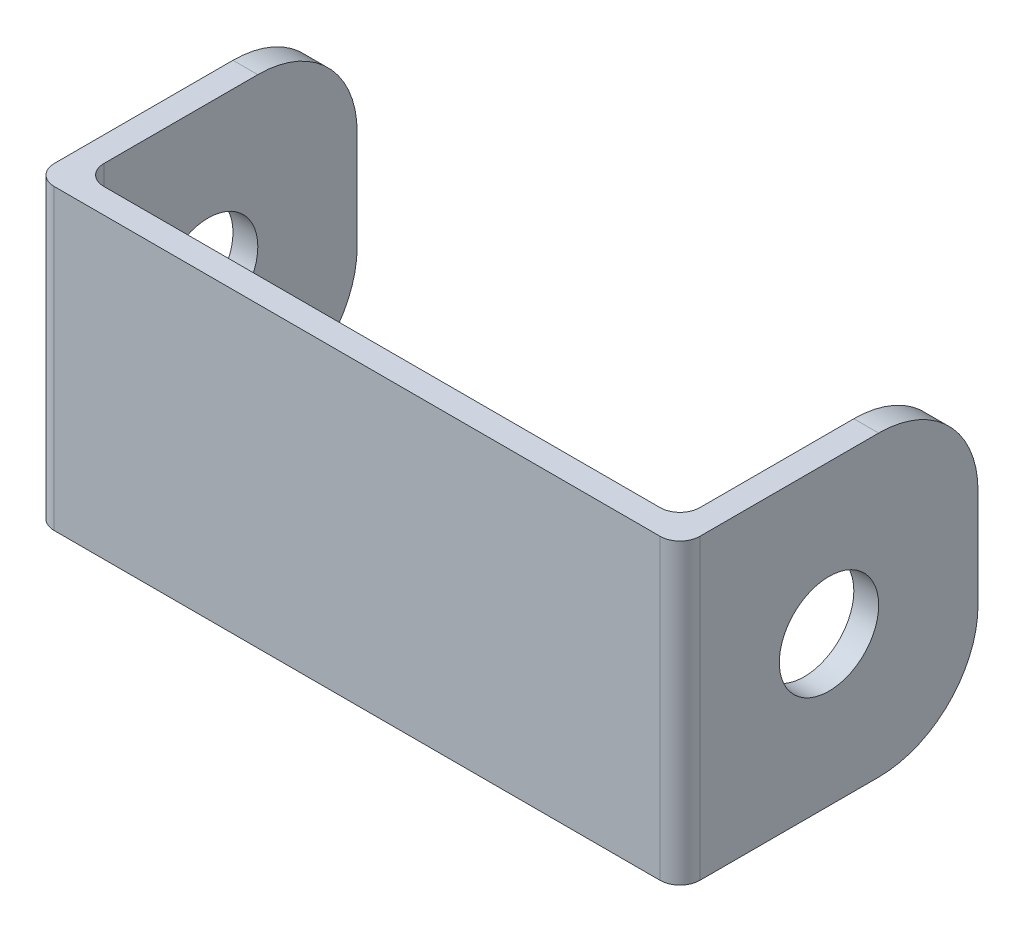
ISO-10303-21;
HEADER;
FILE_DESCRIPTION(('STEP AP214'),'2;1');
FILE_NAME('part.step','',(''),(''),'','','');
FILE_SCHEMA(('AUTOMOTIVE_DESIGN { 1 0 10303 214 1 1 1 1 }'));
ENDSEC;
DATA;
#1=APPLICATION_CONTEXT('core data for automotive mechanical design processes');
#2=APPLICATION_PROTOCOL_DEFINITION('international standard','automotive_design',2000,#1);
#3=PRODUCT_CONTEXT('',#1,'mechanical');
#4=PRODUCT('Part','Part','',(#3));
#5=PRODUCT_RELATED_PRODUCT_CATEGORY('part','',(#4));
#6=PRODUCT_DEFINITION_FORMATION('','',#4);
#7=PRODUCT_DEFINITION_CONTEXT('part definition',#1,'design');
#8=PRODUCT_DEFINITION('design','',#6,#7);
#9=PRODUCT_DEFINITION_SHAPE('','',#8);
#10=(LENGTH_UNIT() NAMED_UNIT(*) SI_UNIT(.MILLI.,.METRE.));
#11=(NAMED_UNIT(*) PLANE_ANGLE_UNIT() SI_UNIT($,.RADIAN.));
#12=(NAMED_UNIT(*) SI_UNIT($,.STERADIAN.) SOLID_ANGLE_UNIT());
#13=UNCERTAINTY_MEASURE_WITH_UNIT(LENGTH_MEASURE(1.E-05),#10,'distance_accuracy_value','');
#14=(GEOMETRIC_REPRESENTATION_CONTEXT(3) GLOBAL_UNCERTAINTY_ASSIGNED_CONTEXT((#13)) GLOBAL_UNIT_ASSIGNED_CONTEXT((#10,
#11,#12)) REPRESENTATION_CONTEXT('',''));
#15=CARTESIAN_POINT('',(0.,0.,0.));
#16=DIRECTION('',(0.,0.,1.));
#17=DIRECTION('',(1.,0.,0.));
#18=AXIS2_PLACEMENT_3D('',#15,#16,#17);
#19=CARTESIAN_POINT('',(-8.73125000000002,38.1,-27.9796875));
#20=DIRECTION('',(0.,0.,1.));
#21=DIRECTION('',(1.,0.,0.));
#22=AXIS2_PLACEMENT_3D('',#19,#20,#21);
#23=PLANE('',#22);
#24=DIRECTION('',(0.,-1.,0.));
#25=VECTOR('',#24,1.);
#26=CARTESIAN_POINT('',(-11.90625,38.1,-27.9796875));
#27=LINE('',#26,#25);
#28=CARTESIAN_POINT('',(-11.90625,25.4,-27.9796875));
#29=VERTEX_POINT('',#28);
#30=CARTESIAN_POINT('',(-11.90625,12.7,-27.9796875));
#31=VERTEX_POINT('',#30);
#32=EDGE_CURVE('E209',#29,#31,#27,.T.);
#33=ORIENTED_EDGE('',*,*,#32,.F.);
#34=DIRECTION('',(-1.,0.,0.));
#35=VECTOR('',#34,1.);
#36=CARTESIAN_POINT('',(-8.73125000000002,25.4,-27.9796875));
#37=LINE('',#36,#35);
#38=CARTESIAN_POINT('',(-8.73125000000002,25.4,-27.9796875));
#39=VERTEX_POINT('',#38);
#40=EDGE_CURVE('E150',#29,#39,#37,.F.);
#41=ORIENTED_EDGE('',*,*,#40,.T.);
#42=DIRECTION('',(0.,-1.,0.));
#43=VECTOR('',#42,1.);
#44=CARTESIAN_POINT('',(-8.73125000000002,38.1,-27.9796875));
#45=LINE('',#44,#43);
#46=CARTESIAN_POINT('',(-8.73125000000002,12.7,-27.9796875));
#47=VERTEX_POINT('',#46);
#48=EDGE_CURVE('E189',#39,#47,#45,.T.);
#49=ORIENTED_EDGE('',*,*,#48,.T.);
#50=DIRECTION('',(-1.,0.,0.));
#51=VECTOR('',#50,1.);
#52=CARTESIAN_POINT('',(-8.73125000000002,12.7,-27.9796875));
#53=LINE('',#52,#51);
#54=EDGE_CURVE('E155',#47,#31,#53,.T.);
#55=ORIENTED_EDGE('',*,*,#54,.T.);
#56=EDGE_LOOP('',(#33,#41,#49,#55));
#57=FACE_BOUND('',#56,.T.);
#58=ADVANCED_FACE('F32',(#57),#23,.F.);
#59=CARTESIAN_POINT('',(-11.90625,38.1,-27.9796875));
#60=DIRECTION('',(1.,0.,0.));
#61=DIRECTION('',(0.,0.,-1.));
#62=AXIS2_PLACEMENT_3D('',#59,#60,#61);
#63=PLANE('',#62);
#64=CARTESIAN_POINT('',(-11.90625,19.05,-8.92968749999998));
#65=DIRECTION('',(1.,0.,0.));
#66=DIRECTION('',(0.,0.,-1.));
#67=AXIS2_PLACEMENT_3D('',#64,#65,#66);
#68=CIRCLE('',#67,6.35);
#69=CARTESIAN_POINT('',(-11.90625,19.05,-15.2796875));
#70=VERTEX_POINT('',#69);
#71=EDGE_CURVE('E214',#70,#70,#68,.T.);
#72=ORIENTED_EDGE('',*,*,#71,.T.);
#73=EDGE_LOOP('',(#72));
#74=FACE_BOUND('',#73,.T.);
#75=DIRECTION('',(0.,0.,1.));
#76=VECTOR('',#75,1.);
#77=CARTESIAN_POINT('',(-11.90625,0.,-27.9796875));
#78=LINE('',#77,#76);
#79=CARTESIAN_POINT('',(-11.90625,0.,-15.2796875));
#80=VERTEX_POINT('',#79);
#81=CARTESIAN_POINT('',(-11.90625,0.,7.58031250000001));
#82=VERTEX_POINT('',#81);
#83=EDGE_CURVE('E190',#80,#82,#78,.T.);
#84=ORIENTED_EDGE('',*,*,#83,.T.);
#85=DIRECTION('',(0.,-1.,0.));
#86=VECTOR('',#85,1.);
#87=CARTESIAN_POINT('',(-11.90625,38.1,7.58031250000001));
#88=LINE('',#87,#86);
#89=CARTESIAN_POINT('',(-11.90625,38.1,7.58031250000001));
#90=VERTEX_POINT('',#89);
#91=EDGE_CURVE('E171',#82,#90,#88,.F.);
#92=ORIENTED_EDGE('',*,*,#91,.T.);
#93=DIRECTION('',(0.,0.,1.));
#94=VECTOR('',#93,1.);
#95=CARTESIAN_POINT('',(-11.90625,38.1,-27.9796875));
#96=LINE('',#95,#94);
#97=CARTESIAN_POINT('',(-11.90625,38.1,-15.2796875));
#98=VERTEX_POINT('',#97);
#99=EDGE_CURVE('E161',#98,#90,#96,.T.);
#100=ORIENTED_EDGE('',*,*,#99,.F.);
#101=CARTESIAN_POINT('',(-11.90625,25.4,-15.2796875));
#102=DIRECTION('',(1.,0.,0.));
#103=DIRECTION('',(0.,0.,-1.));
#104=AXIS2_PLACEMENT_3D('',#101,#102,#103);
#105=CIRCLE('',#104,12.7);
#106=EDGE_CURVE('E145',#98,#29,#105,.F.);
#107=ORIENTED_EDGE('',*,*,#106,.T.);
#108=ORIENTED_EDGE('',*,*,#32,.T.);
#109=CARTESIAN_POINT('',(-11.90625,12.7,-15.2796875));
#110=DIRECTION('',(1.,0.,0.));
#111=DIRECTION('',(0.,0.,-1.));
#112=AXIS2_PLACEMENT_3D('',#109,#110,#111);
#113=CIRCLE('',#112,12.7);
#114=EDGE_CURVE('E156',#31,#80,#113,.F.);
#115=ORIENTED_EDGE('',*,*,#114,.T.);
#116=EDGE_LOOP('',(#84,#92,#100,#107,#108,#115));
#117=FACE_BOUND('',#116,.T.);
#118=ADVANCED_FACE('F169',(#74,#117),#63,.F.);
#119=CARTESIAN_POINT('',(-11.90625,38.1,10.1203125));
#120=DIRECTION('',(0.,0.,-1.));
#121=DIRECTION('',(-1.,0.,0.));
#122=AXIS2_PLACEMENT_3D('',#119,#120,#121);
#123=PLANE('',#122);
#124=DIRECTION('',(1.,0.,0.));
#125=VECTOR('',#124,1.);
#126=CARTESIAN_POINT('',(-11.90625,0.,10.1203125));
#127=LINE('',#126,#125);
#128=CARTESIAN_POINT('',(-9.36625,0.,10.1203125));
#129=VERTEX_POINT('',#128);
#130=CARTESIAN_POINT('',(68.10375,0.,10.1203125));
#131=VERTEX_POINT('',#130);
#132=EDGE_CURVE('E192',#129,#131,#127,.T.);
#133=ORIENTED_EDGE('',*,*,#132,.T.);
#134=DIRECTION('',(0.,-1.,0.));
#135=VECTOR('',#134,1.);
#136=CARTESIAN_POINT('',(68.10375,38.1,10.1203125));
#137=LINE('',#136,#135);
#138=CARTESIAN_POINT('',(68.10375,38.1,10.1203125));
#139=VERTEX_POINT('',#138);
#140=EDGE_CURVE('E255',#131,#139,#137,.F.);
#141=ORIENTED_EDGE('',*,*,#140,.T.);
#142=DIRECTION('',(1.,0.,0.));
#143=VECTOR('',#142,1.);
#144=CARTESIAN_POINT('',(-11.90625,38.1,10.1203125));
#145=LINE('',#144,#143);
#146=CARTESIAN_POINT('',(-9.36625,38.1,10.1203125));
#147=VERTEX_POINT('',#146);
#148=EDGE_CURVE('E172',#147,#139,#145,.T.);
#149=ORIENTED_EDGE('',*,*,#148,.F.);
#150=DIRECTION('',(0.,-1.,0.));
#151=VECTOR('',#150,1.);
#152=CARTESIAN_POINT('',(-9.36625,38.1,10.1203125));
#153=LINE('',#152,#151);
#154=EDGE_CURVE('E252',#147,#129,#153,.T.);
#155=ORIENTED_EDGE('',*,*,#154,.T.);
#156=EDGE_LOOP('',(#133,#141,#149,#155));
#157=FACE_BOUND('',#156,.T.);
#158=ADVANCED_FACE('F308',(#157),#123,.F.);
#159=CARTESIAN_POINT('',(70.64375,38.1,10.1203125));
#160=DIRECTION('',(-1.,0.,0.));
#161=DIRECTION('',(0.,0.,1.));
#162=AXIS2_PLACEMENT_3D('',#159,#160,#161);
#163=PLANE('',#162);
#164=CARTESIAN_POINT('',(70.64375,19.05,-8.92968750000001));
#165=DIRECTION('',(1.,0.,0.));
#166=DIRECTION('',(0.,0.,-1.));
#167=AXIS2_PLACEMENT_3D('',#164,#165,#166);
#168=CIRCLE('',#167,6.35);
#169=CARTESIAN_POINT('',(70.64375,19.05,-15.2796875));
#170=VERTEX_POINT('',#169);
#171=EDGE_CURVE('E498',#170,#170,#168,.T.);
#172=ORIENTED_EDGE('',*,*,#171,.F.);
#173=EDGE_LOOP('',(#172));
#174=FACE_BOUND('',#173,.T.);
#175=DIRECTION('',(0.,0.,-1.));
#176=VECTOR('',#175,1.);
#177=CARTESIAN_POINT('',(70.64375,38.1,10.1203125));
#178=LINE('',#177,#176);
#179=CARTESIAN_POINT('',(70.64375,38.1,7.58031250000001));
#180=VERTEX_POINT('',#179);
#181=CARTESIAN_POINT('',(70.64375,38.1,-15.2796875));
#182=VERTEX_POINT('',#181);
#183=EDGE_CURVE('E175',#180,#182,#178,.T.);
#184=ORIENTED_EDGE('',*,*,#183,.F.);
#185=DIRECTION('',(0.,-1.,0.));
#186=VECTOR('',#185,1.);
#187=CARTESIAN_POINT('',(70.64375,38.1,7.58031250000001));
#188=LINE('',#187,#186);
#189=CARTESIAN_POINT('',(70.64375,0.,7.58031250000001));
#190=VERTEX_POINT('',#189);
#191=EDGE_CURVE('E245',#180,#190,#188,.T.);
#192=ORIENTED_EDGE('',*,*,#191,.T.);
#193=DIRECTION('',(0.,0.,-1.));
#194=VECTOR('',#193,1.);
#195=CARTESIAN_POINT('',(70.64375,0.,10.1203125));
#196=LINE('',#195,#194);
#197=CARTESIAN_POINT('',(70.64375,0.,-15.2796875));
#198=VERTEX_POINT('',#197);
#199=EDGE_CURVE('E195',#190,#198,#196,.T.);
#200=ORIENTED_EDGE('',*,*,#199,.T.);
#201=CARTESIAN_POINT('',(70.64375,12.7,-15.2796875));
#202=DIRECTION('',(-1.,0.,0.));
#203=DIRECTION('',(0.,0.,1.));
#204=AXIS2_PLACEMENT_3D('',#201,#202,#203);
#205=CIRCLE('',#204,12.7);
#206=CARTESIAN_POINT('',(70.64375,12.7,-27.9796875));
#207=VERTEX_POINT('',#206);
#208=EDGE_CURVE('E243',#198,#207,#205,.F.);
#209=ORIENTED_EDGE('',*,*,#208,.T.);
#210=DIRECTION('',(0.,-1.,0.));
#211=VECTOR('',#210,1.);
#212=CARTESIAN_POINT('',(70.64375,38.1,-27.9796875));
#213=LINE('',#212,#211);
#214=CARTESIAN_POINT('',(70.64375,25.4,-27.9796875));
#215=VERTEX_POINT('',#214);
#216=EDGE_CURVE('E206',#215,#207,#213,.T.);
#217=ORIENTED_EDGE('',*,*,#216,.F.);
#218=CARTESIAN_POINT('',(70.64375,25.4,-15.2796875));
#219=DIRECTION('',(-1.,0.,0.));
#220=DIRECTION('',(0.,0.,1.));
#221=AXIS2_PLACEMENT_3D('',#218,#219,#220);
#222=CIRCLE('',#221,12.7);
#223=EDGE_CURVE('E240',#215,#182,#222,.F.);
#224=ORIENTED_EDGE('',*,*,#223,.T.);
#225=EDGE_LOOP('',(#184,#192,#200,#209,#217,#224));
#226=FACE_BOUND('',#225,.T.);
#227=ADVANCED_FACE('F316',(#174,#226),#163,.F.);
#228=CARTESIAN_POINT('',(70.64375,38.1,-27.9796875));
#229=DIRECTION('',(0.,0.,1.));
#230=DIRECTION('',(1.,0.,0.));
#231=AXIS2_PLACEMENT_3D('',#228,#229,#230);
#232=PLANE('',#231);
#233=ORIENTED_EDGE('',*,*,#216,.T.);
#234=DIRECTION('',(-1.,0.,0.));
#235=VECTOR('',#234,1.);
#236=CARTESIAN_POINT('',(70.64375,12.7,-27.9796875));
#237=LINE('',#236,#235);
#238=CARTESIAN_POINT('',(67.46875,12.7,-27.9796875));
#239=VERTEX_POINT('',#238);
#240=EDGE_CURVE('E233',#207,#239,#237,.T.);
#241=ORIENTED_EDGE('',*,*,#240,.T.);
#242=DIRECTION('',(0.,-1.,0.));
#243=VECTOR('',#242,1.);
#244=CARTESIAN_POINT('',(67.46875,38.1,-27.9796875));
#245=LINE('',#244,#243);
#246=CARTESIAN_POINT('',(67.46875,25.4,-27.9796875));
#247=VERTEX_POINT('',#246);
#248=EDGE_CURVE('E203',#247,#239,#245,.T.);
#249=ORIENTED_EDGE('',*,*,#248,.F.);
#250=DIRECTION('',(-1.,0.,0.));
#251=VECTOR('',#250,1.);
#252=CARTESIAN_POINT('',(70.64375,25.4,-27.9796875));
#253=LINE('',#252,#251);
#254=EDGE_CURVE('E231',#247,#215,#253,.F.);
#255=ORIENTED_EDGE('',*,*,#254,.T.);
#256=EDGE_LOOP('',(#233,#241,#249,#255));
#257=FACE_BOUND('',#256,.T.);
#258=ADVANCED_FACE('F325',(#257),#232,.F.);
#259=CARTESIAN_POINT('',(67.46875,38.1,-27.9796875));
#260=DIRECTION('',(1.,0.,0.));
#261=DIRECTION('',(0.,0.,-1.));
#262=AXIS2_PLACEMENT_3D('',#259,#260,#261);
#263=PLANE('',#262);
#264=CARTESIAN_POINT('',(67.46875,19.05,-8.92968750000001));
#265=DIRECTION('',(1.,0.,0.));
#266=DIRECTION('',(0.,0.,-1.));
#267=AXIS2_PLACEMENT_3D('',#264,#265,#266);
#268=CIRCLE('',#267,6.35);
#269=CARTESIAN_POINT('',(67.46875,19.05,-15.2796875));
#270=VERTEX_POINT('',#269);
#271=EDGE_CURVE('E180',#270,#270,#268,.T.);
#272=ORIENTED_EDGE('',*,*,#271,.T.);
#273=EDGE_LOOP('',(#272));
#274=FACE_BOUND('',#273,.T.);
#275=DIRECTION('',(0.,0.,1.));
#276=VECTOR('',#275,1.);
#277=CARTESIAN_POINT('',(67.46875,0.,-27.9796875));
#278=LINE('',#277,#276);
#279=CARTESIAN_POINT('',(67.46875,0.,-15.2796875));
#280=VERTEX_POINT('',#279);
#281=CARTESIAN_POINT('',(67.46875,0.,4.40531249999998));
#282=VERTEX_POINT('',#281);
#283=EDGE_CURVE('E197',#280,#282,#278,.T.);
#284=ORIENTED_EDGE('',*,*,#283,.T.);
#285=DIRECTION('',(0.,-1.,0.));
#286=VECTOR('',#285,1.);
#287=CARTESIAN_POINT('',(67.46875,38.1,4.4053125));
#288=LINE('',#287,#286);
#289=CARTESIAN_POINT('',(67.46875,38.1,4.40531249999998));
#290=VERTEX_POINT('',#289);
#291=EDGE_CURVE('E269',#282,#290,#288,.F.);
#292=ORIENTED_EDGE('',*,*,#291,.T.);
#293=DIRECTION('',(0.,0.,1.));
#294=VECTOR('',#293,1.);
#295=CARTESIAN_POINT('',(67.46875,38.1,-27.9796875));
#296=LINE('',#295,#294);
#297=CARTESIAN_POINT('',(67.46875,38.1,-15.2796875));
#298=VERTEX_POINT('',#297);
#299=EDGE_CURVE('E184',#298,#290,#296,.T.);
#300=ORIENTED_EDGE('',*,*,#299,.F.);
#301=CARTESIAN_POINT('',(67.46875,25.4,-15.2796875));
#302=DIRECTION('',(1.,0.,0.));
#303=DIRECTION('',(0.,0.,-1.));
#304=AXIS2_PLACEMENT_3D('',#301,#302,#303);
#305=CIRCLE('',#304,12.7);
#306=EDGE_CURVE('E236',#298,#247,#305,.F.);
#307=ORIENTED_EDGE('',*,*,#306,.T.);
#308=ORIENTED_EDGE('',*,*,#248,.T.);
#309=CARTESIAN_POINT('',(67.46875,12.7,-15.2796875));
#310=DIRECTION('',(1.,0.,0.));
#311=DIRECTION('',(0.,0.,-1.));
#312=AXIS2_PLACEMENT_3D('',#309,#310,#311);
#313=CIRCLE('',#312,12.7);
#314=EDGE_CURVE('E238',#239,#280,#313,.F.);
#315=ORIENTED_EDGE('',*,*,#314,.T.);
#316=EDGE_LOOP('',(#284,#292,#300,#307,#308,#315));
#317=FACE_BOUND('',#316,.T.);
#318=ADVANCED_FACE('F284',(#274,#317),#263,.F.);
#319=CARTESIAN_POINT('',(67.46875,38.1,6.9453125));
#320=DIRECTION('',(0.,0.,1.));
#321=DIRECTION('',(1.,0.,0.));
#322=AXIS2_PLACEMENT_3D('',#319,#320,#321);
#323=PLANE('',#322);
#324=DIRECTION('',(-1.,0.,0.));
#325=VECTOR('',#324,1.);
#326=CARTESIAN_POINT('',(67.46875,0.,6.9453125));
#327=LINE('',#326,#325);
#328=CARTESIAN_POINT('',(64.92875,0.,6.9453125));
#329=VERTEX_POINT('',#328);
#330=CARTESIAN_POINT('',(-6.19124999999998,0.,6.94531250000001));
#331=VERTEX_POINT('',#330);
#332=EDGE_CURVE('E177',#329,#331,#327,.T.);
#333=ORIENTED_EDGE('',*,*,#332,.T.);
#334=DIRECTION('',(0.,-1.,0.));
#335=VECTOR('',#334,1.);
#336=CARTESIAN_POINT('',(-6.19125000000001,38.1,6.94531250000001));
#337=LINE('',#336,#335);
#338=CARTESIAN_POINT('',(-6.19124999999998,38.1,6.94531250000001));
#339=VERTEX_POINT('',#338);
#340=EDGE_CURVE('E47',#331,#339,#337,.F.);
#341=ORIENTED_EDGE('',*,*,#340,.T.);
#342=DIRECTION('',(-1.,0.,0.));
#343=VECTOR('',#342,1.);
#344=CARTESIAN_POINT('',(67.46875,38.1,6.9453125));
#345=LINE('',#344,#343);
#346=CARTESIAN_POINT('',(64.92875,38.1,6.9453125));
#347=VERTEX_POINT('',#346);
#348=EDGE_CURVE('E186',#347,#339,#345,.T.);
#349=ORIENTED_EDGE('',*,*,#348,.F.);
#350=DIRECTION('',(0.,-1.,0.));
#351=VECTOR('',#350,1.);
#352=CARTESIAN_POINT('',(64.92875,0.,6.9453125));
#353=LINE('',#352,#351);
#354=EDGE_CURVE('E265',#347,#329,#353,.T.);
#355=ORIENTED_EDGE('',*,*,#354,.T.);
#356=EDGE_LOOP('',(#333,#341,#349,#355));
#357=FACE_BOUND('',#356,.T.);
#358=ADVANCED_FACE('F286',(#357),#323,.F.);
#359=CARTESIAN_POINT('',(-8.73125000000001,38.1,6.94531250000001));
#360=DIRECTION('',(-1.,0.,0.));
#361=DIRECTION('',(0.,0.,1.));
#362=AXIS2_PLACEMENT_3D('',#359,#360,#361);
#363=PLANE('',#362);
#364=CARTESIAN_POINT('',(-8.73125000000001,19.05,-8.92968749999998));
#365=DIRECTION('',(-1.,0.,0.));
#366=DIRECTION('',(0.,0.,1.));
#367=AXIS2_PLACEMENT_3D('',#364,#365,#366);
#368=CIRCLE('',#367,6.35);
#369=CARTESIAN_POINT('',(-8.73125000000001,19.05,-2.57968749999998));
#370=VERTEX_POINT('',#369);
#371=EDGE_CURVE('E211',#370,#370,#368,.T.);
#372=ORIENTED_EDGE('',*,*,#371,.T.);
#373=EDGE_LOOP('',(#372));
#374=FACE_BOUND('',#373,.T.);
#375=DIRECTION('',(0.,0.,-1.));
#376=VECTOR('',#375,1.);
#377=CARTESIAN_POINT('',(-8.73125000000001,38.1,6.94531250000001));
#378=LINE('',#377,#376);
#379=CARTESIAN_POINT('',(-8.73125000000001,38.1,4.40531250000001));
#380=VERTEX_POINT('',#379);
#381=CARTESIAN_POINT('',(-8.73125000000001,38.1,-15.2796875));
#382=VERTEX_POINT('',#381);
#383=EDGE_CURVE('E164',#380,#382,#378,.T.);
#384=ORIENTED_EDGE('',*,*,#383,.F.);
#385=DIRECTION('',(0.,-1.,0.));
#386=VECTOR('',#385,1.);
#387=CARTESIAN_POINT('',(-8.73125000000001,0.,4.40531250000001));
#388=LINE('',#387,#386);
#389=CARTESIAN_POINT('',(-8.73125000000001,0.,4.40531250000001));
#390=VERTEX_POINT('',#389);
#391=EDGE_CURVE('E262',#380,#390,#388,.T.);
#392=ORIENTED_EDGE('',*,*,#391,.T.);
#393=DIRECTION('',(0.,0.,-1.));
#394=VECTOR('',#393,1.);
#395=CARTESIAN_POINT('',(-8.73125000000001,0.,6.94531250000001));
#396=LINE('',#395,#394);
#397=CARTESIAN_POINT('',(-8.73125000000001,0.,-15.2796875));
#398=VERTEX_POINT('',#397);
#399=EDGE_CURVE('E173',#390,#398,#396,.T.);
#400=ORIENTED_EDGE('',*,*,#399,.T.);
#401=CARTESIAN_POINT('',(-8.73125000000001,12.7,-15.2796875));
#402=DIRECTION('',(-1.,0.,0.));
#403=DIRECTION('',(0.,0.,1.));
#404=AXIS2_PLACEMENT_3D('',#401,#402,#403);
#405=CIRCLE('',#404,12.7);
#406=EDGE_CURVE('E221',#398,#47,#405,.F.);
#407=ORIENTED_EDGE('',*,*,#406,.T.);
#408=ORIENTED_EDGE('',*,*,#48,.F.);
#409=CARTESIAN_POINT('',(-8.73125000000001,25.4,-15.2796875));
#410=DIRECTION('',(-1.,0.,0.));
#411=DIRECTION('',(0.,0.,1.));
#412=AXIS2_PLACEMENT_3D('',#409,#410,#411);
#413=CIRCLE('',#412,12.7);
#414=EDGE_CURVE('E223',#39,#382,#413,.F.);
#415=ORIENTED_EDGE('',*,*,#414,.T.);
#416=EDGE_LOOP('',(#384,#392,#400,#407,#408,#415));
#417=FACE_BOUND('',#416,.T.);
#418=ADVANCED_FACE('F293',(#374,#417),#363,.F.);
#419=CARTESIAN_POINT('',(0.,38.1,0.));
#420=DIRECTION('',(0.,1.,0.));
#421=DIRECTION('',(0.,0.,1.));
#422=AXIS2_PLACEMENT_3D('',#419,#420,#421);
#423=PLANE('',#422);
#424=ORIENTED_EDGE('',*,*,#148,.T.);
#425=CARTESIAN_POINT('',(68.10375,38.1,7.58031250000001));
#426=DIRECTION('',(0.,1.,0.));
#427=DIRECTION('',(0.,0.,1.));
#428=AXIS2_PLACEMENT_3D('',#425,#426,#427);
#429=CIRCLE('',#428,2.54);
#430=EDGE_CURVE('E259',#139,#180,#429,.T.);
#431=ORIENTED_EDGE('',*,*,#430,.T.);
#432=ORIENTED_EDGE('',*,*,#183,.T.);
#433=DIRECTION('',(-1.,0.,0.));
#434=VECTOR('',#433,1.);
#435=CARTESIAN_POINT('',(67.46875,38.1,-15.2796875));
#436=LINE('',#435,#434);
#437=EDGE_CURVE('E166',#182,#298,#436,.T.);
#438=ORIENTED_EDGE('',*,*,#437,.T.);
#439=ORIENTED_EDGE('',*,*,#299,.T.);
#440=CARTESIAN_POINT('',(64.92875,38.1,4.4053125));
#441=DIRECTION('',(0.,1.,0.));
#442=DIRECTION('',(0.,0.,1.));
#443=AXIS2_PLACEMENT_3D('',#440,#441,#442);
#444=CIRCLE('',#443,2.54);
#445=EDGE_CURVE('E11',#290,#347,#444,.F.);
#446=ORIENTED_EDGE('',*,*,#445,.T.);
#447=ORIENTED_EDGE('',*,*,#348,.T.);
#448=CARTESIAN_POINT('',(-6.19125000000001,38.1,4.40531250000001));
#449=DIRECTION('',(0.,1.,0.));
#450=DIRECTION('',(0.,0.,1.));
#451=AXIS2_PLACEMENT_3D('',#448,#449,#450);
#452=CIRCLE('',#451,2.54);
#453=EDGE_CURVE('E273',#339,#380,#452,.F.);
#454=ORIENTED_EDGE('',*,*,#453,.T.);
#455=ORIENTED_EDGE('',*,*,#383,.T.);
#456=DIRECTION('',(-1.,0.,0.));
#457=VECTOR('',#456,1.);
#458=CARTESIAN_POINT('',(-11.90625,38.1,-15.2796875));
#459=LINE('',#458,#457);
#460=EDGE_CURVE('E149',#382,#98,#459,.T.);
#461=ORIENTED_EDGE('',*,*,#460,.T.);
#462=ORIENTED_EDGE('',*,*,#99,.T.);
#463=CARTESIAN_POINT('',(-9.36625,38.1,7.58031250000001));
#464=DIRECTION('',(0.,1.,0.));
#465=DIRECTION('',(0.,0.,1.));
#466=AXIS2_PLACEMENT_3D('',#463,#464,#465);
#467=CIRCLE('',#466,2.54);
#468=EDGE_CURVE('E257',#90,#147,#467,.T.);
#469=ORIENTED_EDGE('',*,*,#468,.T.);
#470=EDGE_LOOP('',(#424,#431,#432,#438,#439,#446,#447,#454,#455,#461,#462,#469));
#471=FACE_BOUND('',#470,.T.);
#472=ADVANCED_FACE('F160',(#471),#423,.T.);
#473=CARTESIAN_POINT('',(0.,0.,0.));
#474=DIRECTION('',(0.,1.,0.));
#475=DIRECTION('',(0.,0.,1.));
#476=AXIS2_PLACEMENT_3D('',#473,#474,#475);
#477=PLANE('',#476);
#478=ORIENTED_EDGE('',*,*,#199,.F.);
#479=CARTESIAN_POINT('',(68.10375,0.,7.58031250000001));
#480=DIRECTION('',(0.,1.,0.));
#481=DIRECTION('',(0.,0.,1.));
#482=AXIS2_PLACEMENT_3D('',#479,#480,#481);
#483=CIRCLE('',#482,2.54);
#484=EDGE_CURVE('E250',#190,#131,#483,.F.);
#485=ORIENTED_EDGE('',*,*,#484,.T.);
#486=ORIENTED_EDGE('',*,*,#132,.F.);
#487=CARTESIAN_POINT('',(-9.36625,0.,7.58031250000001));
#488=DIRECTION('',(0.,1.,0.));
#489=DIRECTION('',(0.,0.,1.));
#490=AXIS2_PLACEMENT_3D('',#487,#488,#489);
#491=CIRCLE('',#490,2.54);
#492=EDGE_CURVE('E248',#129,#82,#491,.F.);
#493=ORIENTED_EDGE('',*,*,#492,.T.);
#494=ORIENTED_EDGE('',*,*,#83,.F.);
#495=DIRECTION('',(-1.,0.,0.));
#496=VECTOR('',#495,1.);
#497=CARTESIAN_POINT('',(0.,0.,-15.2796875));
#498=LINE('',#497,#496);
#499=EDGE_CURVE('E228',#80,#398,#498,.F.);
#500=ORIENTED_EDGE('',*,*,#499,.T.);
#501=ORIENTED_EDGE('',*,*,#399,.F.);
#502=CARTESIAN_POINT('',(-6.19125000000001,0.,4.40531250000001));
#503=DIRECTION('',(0.,1.,0.));
#504=DIRECTION('',(0.,0.,1.));
#505=AXIS2_PLACEMENT_3D('',#502,#503,#504);
#506=CIRCLE('',#505,2.54);
#507=EDGE_CURVE('E271',#390,#331,#506,.T.);
#508=ORIENTED_EDGE('',*,*,#507,.T.);
#509=ORIENTED_EDGE('',*,*,#332,.F.);
#510=CARTESIAN_POINT('',(64.92875,0.,4.4053125));
#511=DIRECTION('',(0.,1.,0.));
#512=DIRECTION('',(0.,0.,1.));
#513=AXIS2_PLACEMENT_3D('',#510,#511,#512);
#514=CIRCLE('',#513,2.54);
#515=EDGE_CURVE('E40',#329,#282,#514,.T.);
#516=ORIENTED_EDGE('',*,*,#515,.T.);
#517=ORIENTED_EDGE('',*,*,#283,.F.);
#518=DIRECTION('',(-1.,0.,0.));
#519=VECTOR('',#518,1.);
#520=CARTESIAN_POINT('',(0.,0.,-15.2796875));
#521=LINE('',#520,#519);
#522=EDGE_CURVE('E225',#280,#198,#521,.F.);
#523=ORIENTED_EDGE('',*,*,#522,.T.);
#524=EDGE_LOOP('',(#478,#485,#486,#493,#494,#500,#501,#508,#509,#516,#517,#523));
#525=FACE_BOUND('',#524,.T.);
#526=ADVANCED_FACE('F278',(#525),#477,.F.);
#527=CARTESIAN_POINT('',(-11.90625,19.05,-8.92968749999998));
#528=DIRECTION('',(1.,0.,0.));
#529=DIRECTION('',(0.,0.,-1.));
#530=AXIS2_PLACEMENT_3D('',#527,#528,#529);
#531=CYLINDRICAL_SURFACE('',#530,6.35);
#532=ORIENTED_EDGE('',*,*,#71,.F.);
#533=EDGE_LOOP('',(#532));
#534=FACE_BOUND('',#533,.T.);
#535=ORIENTED_EDGE('',*,*,#371,.F.);
#536=EDGE_LOOP('',(#535));
#537=FACE_BOUND('',#536,.T.);
#538=ADVANCED_FACE('F352',(#534,#537),#531,.F.);
#539=ORIENTED_EDGE('',*,*,#171,.T.);
#540=EDGE_LOOP('',(#539));
#541=FACE_BOUND('',#540,.T.);
#542=ORIENTED_EDGE('',*,*,#271,.F.);
#543=EDGE_LOOP('',(#542));
#544=FACE_BOUND('',#543,.T.);
#545=ADVANCED_FACE('F348',(#541,#544),#531,.F.);
#546=CARTESIAN_POINT('',(0.,25.4,-15.2796875));
#547=DIRECTION('',(1.,0.,0.));
#548=DIRECTION('',(0.,0.,-1.));
#549=AXIS2_PLACEMENT_3D('',#546,#547,#548);
#550=CYLINDRICAL_SURFACE('',#549,12.7);
#551=ORIENTED_EDGE('',*,*,#414,.F.);
#552=ORIENTED_EDGE('',*,*,#40,.F.);
#553=ORIENTED_EDGE('',*,*,#106,.F.);
#554=ORIENTED_EDGE('',*,*,#460,.F.);
#555=EDGE_LOOP('',(#551,#552,#553,#554));
#556=FACE_BOUND('',#555,.T.);
#557=ADVANCED_FACE('F148',(#556),#550,.T.);
#558=CARTESIAN_POINT('',(-8.73125000000003,12.7,-15.2796875));
#559=DIRECTION('',(-1.,0.,0.));
#560=DIRECTION('',(0.,0.,1.));
#561=AXIS2_PLACEMENT_3D('',#558,#559,#560);
#562=CYLINDRICAL_SURFACE('',#561,12.7);
#563=ORIENTED_EDGE('',*,*,#406,.F.);
#564=ORIENTED_EDGE('',*,*,#499,.F.);
#565=ORIENTED_EDGE('',*,*,#114,.F.);
#566=ORIENTED_EDGE('',*,*,#54,.F.);
#567=EDGE_LOOP('',(#563,#564,#565,#566));
#568=FACE_BOUND('',#567,.T.);
#569=ADVANCED_FACE('F299',(#568),#562,.T.);
#570=CARTESIAN_POINT('',(70.64375,12.7,-15.2796875));
#571=DIRECTION('',(-1.,0.,0.));
#572=DIRECTION('',(0.,0.,1.));
#573=AXIS2_PLACEMENT_3D('',#570,#571,#572);
#574=CYLINDRICAL_SURFACE('',#573,12.7);
#575=ORIENTED_EDGE('',*,*,#208,.F.);
#576=ORIENTED_EDGE('',*,*,#522,.F.);
#577=ORIENTED_EDGE('',*,*,#314,.F.);
#578=ORIENTED_EDGE('',*,*,#240,.F.);
#579=EDGE_LOOP('',(#575,#576,#577,#578));
#580=FACE_BOUND('',#579,.T.);
#581=ADVANCED_FACE('F329',(#580),#574,.T.);
#582=CARTESIAN_POINT('',(0.,25.4,-15.2796875));
#583=DIRECTION('',(1.,0.,0.));
#584=DIRECTION('',(0.,0.,-1.));
#585=AXIS2_PLACEMENT_3D('',#582,#583,#584);
#586=CYLINDRICAL_SURFACE('',#585,12.7);
#587=ORIENTED_EDGE('',*,*,#223,.F.);
#588=ORIENTED_EDGE('',*,*,#254,.F.);
#589=ORIENTED_EDGE('',*,*,#306,.F.);
#590=ORIENTED_EDGE('',*,*,#437,.F.);
#591=EDGE_LOOP('',(#587,#588,#589,#590));
#592=FACE_BOUND('',#591,.T.);
#593=ADVANCED_FACE('F322',(#592),#586,.T.);
#594=CARTESIAN_POINT('',(68.10375,38.1,7.58031250000001));
#595=DIRECTION('',(0.,-1.,0.));
#596=DIRECTION('',(0.,0.,-1.));
#597=AXIS2_PLACEMENT_3D('',#594,#595,#596);
#598=CYLINDRICAL_SURFACE('',#597,2.54);
#599=ORIENTED_EDGE('',*,*,#430,.F.);
#600=ORIENTED_EDGE('',*,*,#140,.F.);
#601=ORIENTED_EDGE('',*,*,#484,.F.);
#602=ORIENTED_EDGE('',*,*,#191,.F.);
#603=EDGE_LOOP('',(#599,#600,#601,#602));
#604=FACE_BOUND('',#603,.T.);
#605=ADVANCED_FACE('F312',(#604),#598,.T.);
#606=CARTESIAN_POINT('',(-9.36625,38.1,7.58031250000001));
#607=DIRECTION('',(0.,-1.,0.));
#608=DIRECTION('',(0.,0.,-1.));
#609=AXIS2_PLACEMENT_3D('',#606,#607,#608);
#610=CYLINDRICAL_SURFACE('',#609,2.54);
#611=ORIENTED_EDGE('',*,*,#468,.F.);
#612=ORIENTED_EDGE('',*,*,#91,.F.);
#613=ORIENTED_EDGE('',*,*,#492,.F.);
#614=ORIENTED_EDGE('',*,*,#154,.F.);
#615=EDGE_LOOP('',(#611,#612,#613,#614));
#616=FACE_BOUND('',#615,.T.);
#617=ADVANCED_FACE('F303',(#616),#610,.T.);
#618=CARTESIAN_POINT('',(-6.19125000000001,38.1,4.40531250000001));
#619=DIRECTION('',(0.,1.,0.));
#620=DIRECTION('',(0.,0.,1.));
#621=AXIS2_PLACEMENT_3D('',#618,#619,#620);
#622=CYLINDRICAL_SURFACE('',#621,2.54);
#623=ORIENTED_EDGE('',*,*,#453,.F.);
#624=ORIENTED_EDGE('',*,*,#340,.F.);
#625=ORIENTED_EDGE('',*,*,#507,.F.);
#626=ORIENTED_EDGE('',*,*,#391,.F.);
#627=EDGE_LOOP('',(#623,#624,#625,#626));
#628=FACE_BOUND('',#627,.T.);
#629=ADVANCED_FACE('F290',(#628),#622,.F.);
#630=CARTESIAN_POINT('',(64.92875,38.1,4.4053125));
#631=DIRECTION('',(0.,1.,0.));
#632=DIRECTION('',(0.,0.,1.));
#633=AXIS2_PLACEMENT_3D('',#630,#631,#632);
#634=CYLINDRICAL_SURFACE('',#633,2.54);
#635=ORIENTED_EDGE('',*,*,#445,.F.);
#636=ORIENTED_EDGE('',*,*,#291,.F.);
#637=ORIENTED_EDGE('',*,*,#515,.F.);
#638=ORIENTED_EDGE('',*,*,#354,.F.);
#639=EDGE_LOOP('',(#635,#636,#637,#638));
#640=FACE_BOUND('',#639,.T.);
#641=ADVANCED_FACE('F34',(#640),#634,.F.);
#642=CLOSED_SHELL('',(#58,#118,#158,#227,#258,#318,#358,#418,#472,#526,#538,#545,#557,#569,#581,
#593,#605,#617,#629,#641));
#643=MANIFOLD_SOLID_BREP('B2',#642);
#644=ADVANCED_BREP_SHAPE_REPRESENTATION('',(#18,#643),#14);
#645=SHAPE_DEFINITION_REPRESENTATION(#9,#644);
ENDSEC;
END-ISO-10303-21;
